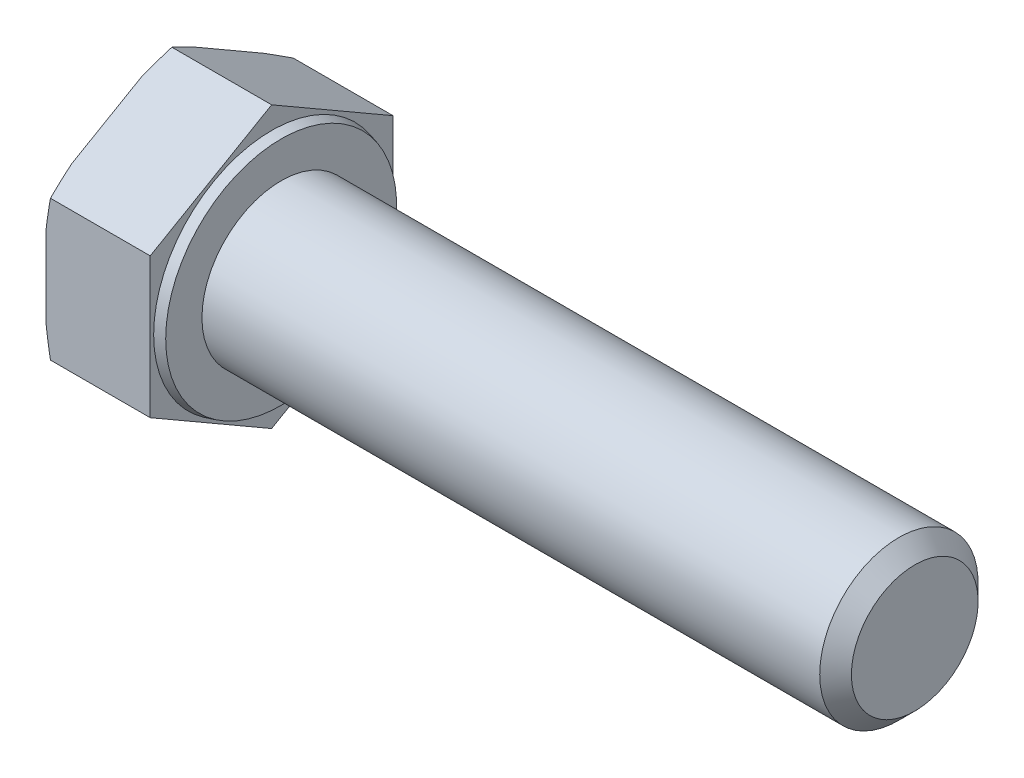
ISO-10303-21;
HEADER;
FILE_DESCRIPTION(('STEP AP214'),'2;1');
FILE_NAME('part.step','',(''),(''),'','','');
FILE_SCHEMA(('AUTOMOTIVE_DESIGN { 1 0 10303 214 1 1 1 1 }'));
ENDSEC;
DATA;
#1=APPLICATION_CONTEXT('core data for automotive mechanical design processes');
#2=APPLICATION_PROTOCOL_DEFINITION('international standard','automotive_design',2000,#1);
#3=PRODUCT_CONTEXT('',#1,'mechanical');
#4=PRODUCT('Part','Part','',(#3));
#5=PRODUCT_RELATED_PRODUCT_CATEGORY('part','',(#4));
#6=PRODUCT_DEFINITION_FORMATION('','',#4);
#7=PRODUCT_DEFINITION_CONTEXT('part definition',#1,'design');
#8=PRODUCT_DEFINITION('design','',#6,#7);
#9=PRODUCT_DEFINITION_SHAPE('','',#8);
#10=(LENGTH_UNIT() NAMED_UNIT(*) SI_UNIT(.MILLI.,.METRE.));
#11=(NAMED_UNIT(*) PLANE_ANGLE_UNIT() SI_UNIT($,.RADIAN.));
#12=(NAMED_UNIT(*) SI_UNIT($,.STERADIAN.) SOLID_ANGLE_UNIT());
#13=UNCERTAINTY_MEASURE_WITH_UNIT(LENGTH_MEASURE(1.E-05),#10,'distance_accuracy_value','');
#14=(GEOMETRIC_REPRESENTATION_CONTEXT(3) GLOBAL_UNCERTAINTY_ASSIGNED_CONTEXT((#13)) GLOBAL_UNIT_ASSIGNED_CONTEXT((#10,
#11,#12)) REPRESENTATION_CONTEXT('',''));
#15=CARTESIAN_POINT('',(0.,0.,0.));
#16=DIRECTION('',(0.,0.,1.));
#17=DIRECTION('',(1.,0.,0.));
#18=AXIS2_PLACEMENT_3D('',#15,#16,#17);
#19=CARTESIAN_POINT('',(40.6,-4.42500000000009,-7.66432482349223));
#20=DIRECTION('',(0.,-0.866025403784441,-0.499999999999995));
#21=DIRECTION('',(0.,0.499999999999995,-0.866025403784442));
#22=AXIS2_PLACEMENT_3D('',#19,#20,#21);
#23=PLANE('',#22);
#24=DIRECTION('',(-1.,0.,0.));
#25=VECTOR('',#24,1.);
#26=CARTESIAN_POINT('',(40.6,-8.85,0.));
#27=LINE('',#26,#25);
#28=CARTESIAN_POINT('',(0.,-8.85,0.));
#29=VERTEX_POINT('',#28);
#30=CARTESIAN_POINT('',(-6.29792306844368,-8.85,0.));
#31=VERTEX_POINT('',#30);
#32=EDGE_CURVE('E164',#29,#31,#27,.T.);
#33=ORIENTED_EDGE('',*,*,#32,.T.);
#34=CARTESIAN_POINT('',(-4.7699615006699,-11.9174022332107,5.3128965151713));
#35=CARTESIAN_POINT('',(-4.83614833570257,-11.8050473190038,5.11829209528478));
#36=CARTESIAN_POINT('',(-4.90167255003095,-11.6925948603644,4.92351872348535));
#37=CARTESIAN_POINT('',(-5.03118559698242,-11.4674663528304,4.53358471020429));
#38=CARTESIAN_POINT('',(-5.09517439305191,-11.3547902986816,4.33842405962226));
#39=CARTESIAN_POINT('',(-5.28456041407139,-11.0163157536771,3.75216895060564));
#40=CARTESIAN_POINT('',(-5.40733223857273,-10.7901468045143,3.3604328395613));
#41=CARTESIAN_POINT('',(-5.64480594732521,-10.3342684187143,2.57082831328319));
#42=CARTESIAN_POINT('',(-5.75941225873481,-10.1045464495324,2.17293819104532));
#43=CARTESIAN_POINT('',(-5.97591685440881,-9.6436033227612,1.37456127607789));
#44=CARTESIAN_POINT('',(-6.07781581130404,-9.41238224520544,0.974074621970503));
#45=CARTESIAN_POINT('',(-6.26134144326315,-8.95638364479248,0.184261877874948));
#46=CARTESIAN_POINT('',(-6.34355573274743,-8.73166601658844,-0.204960471530832));
#47=CARTESIAN_POINT('',(-6.48746045966098,-8.28055127837509,-0.986314118159494));
#48=CARTESIAN_POINT('',(-6.54915189984519,-8.05415425097466,-1.37844527229961));
#49=CARTESIAN_POINT('',(-6.62254434564547,-7.71410474496151,-1.9674282938031));
#50=CARTESIAN_POINT('',(-6.64378861584913,-7.60095958105454,-2.16340146632069));
#51=CARTESIAN_POINT('',(-6.67950592063896,-7.37440457175731,-2.55580625313272));
#52=CARTESIAN_POINT('',(-6.69397933196105,-7.26099474144627,-2.75223784130922));
#53=CARTESIAN_POINT('',(-6.7157765759338,-7.03401139991638,-3.14538452131075));
#54=CARTESIAN_POINT('',(-6.72310096885371,-6.92043790222291,-3.34209958970915));
#55=CARTESIAN_POINT('',(-6.73040192529393,-6.69323186195545,-3.73563199523894));
#56=CARTESIAN_POINT('',(-6.73037853713207,-6.57959931977464,-3.93244933168932));
#57=CARTESIAN_POINT('',(-6.72320871548941,-6.35929562962563,-4.31402651612232));
#58=CARTESIAN_POINT('',(-6.71649505277964,-6.25262090601261,-4.49879255730344));
#59=CARTESIAN_POINT('',(-6.69675463432834,-6.03941600442701,-4.86807427927243));
#60=CARTESIAN_POINT('',(-6.68372760236287,-5.93288583298343,-5.05258994875172));
#61=CARTESIAN_POINT('',(-6.63559663675346,-5.61363013252953,-5.60555704254388));
#62=CARTESIAN_POINT('',(-6.59144268713134,-5.40123548697151,-5.97343535990596));
#63=CARTESIAN_POINT('',(-6.48226269320506,-4.97681311893132,-6.70855646522027));
#64=CARTESIAN_POINT('',(-6.41713860156276,-4.7647919199632,-7.07578795411474));
#65=CARTESIAN_POINT('',(-6.27018625376656,-4.34222339340586,-7.80769811179158));
#66=CARTESIAN_POINT('',(-6.18835790112246,-4.1316760743376,-8.17237676581522));
#67=CARTESIAN_POINT('',(-6.00866271800198,-3.70472589760515,-8.91187616421634));
#68=CARTESIAN_POINT('',(-5.91033992742069,-3.48837165185492,-9.286612710289));
#69=CARTESIAN_POINT('',(-5.70311989656312,-3.05693413716248,-10.0338844060276));
#70=CARTESIAN_POINT('',(-5.59422212603359,-2.84185093252738,-10.4064194443103));
#71=CARTESIAN_POINT('',(-5.36943684134144,-2.41473283183158,-11.1462096955477));
#72=CARTESIAN_POINT('',(-5.25362330968472,-2.2026881429877,-11.5134818701005));
#73=CARTESIAN_POINT('',(-5.07537550670142,-1.88529185166038,-12.0632283728133));
#74=CARTESIAN_POINT('',(-5.01521325258259,-1.77961882394802,-12.2462594258008));
#75=CARTESIAN_POINT('',(-4.89354912869936,-1.56846779942573,-12.6119837283436));
#76=CARTESIAN_POINT('',(-4.83204728425027,-1.462989798971,-12.794676984212));
#77=CARTESIAN_POINT('',(-4.7699615006699,-1.35759776678936,-12.9772213386635));
#78=B_SPLINE_CURVE_WITH_KNOTS('',3,(#34,#35,#36,#37,#38,#39,#40,#41,#42,#43,#44,#45,#46,#47,#48,
#49,#50,#51,#52,#53,#54,#55,#56,#57,#58,#59,#60,#61,#62,#63,#64,#65,#66,#67,#68,#69,#70,#71,#72,
#73,#74,#75,#76,#77),.UNSPECIFIED.,.F.,.F.,(4,2,2,2,2,2,2,2,2,2,2,2,2,2,2,2,2,2,2,2,2,4),(0.,
0.70276173034238,1.40554017472233,2.81157217612387,4.23201032618944,5.6523732571052,
7.02270828812482,8.39297635416767,9.07474696516834,9.75647963740092,10.438158877887,
11.119833635759,11.7601005309412,12.4003954417532,13.6809617128842,14.9676044823533,
16.2542546841745,17.5852978857349,18.9164078632869,20.2352036230902,20.894426976119,
21.553637882061),.UNSPECIFIED.);
#79=CARTESIAN_POINT('',(-6.58000000000003,-7.90869530364146,-1.63038755949604));
#80=VERTEX_POINT('',#79);
#81=EDGE_CURVE('E209',#31,#80,#78,.T.);
#82=ORIENTED_EDGE('',*,*,#81,.T.);
#83=DIRECTION('',(0.,-0.499999999999995,0.866025403784442));
#84=VECTOR('',#83,1.);
#85=CARTESIAN_POINT('',(-6.58,-4.42500000000009,-7.66432482349223));
#86=LINE('',#85,#84);
#87=CARTESIAN_POINT('',(-6.58,-5.36630469635854,-6.03393726399618));
#88=VERTEX_POINT('',#87);
#89=EDGE_CURVE('E219',#88,#80,#86,.T.);
#90=ORIENTED_EDGE('',*,*,#89,.F.);
#91=CARTESIAN_POINT('',(-6.29792306844368,-4.42500000000009,-7.66432482349223));
#92=VERTEX_POINT('',#91);
#93=EDGE_CURVE('E222',#88,#92,#78,.T.);
#94=ORIENTED_EDGE('',*,*,#93,.T.);
#95=DIRECTION('',(-1.,0.,0.));
#96=VECTOR('',#95,1.);
#97=CARTESIAN_POINT('',(40.6,-4.42500000000009,-7.66432482349223));
#98=LINE('',#97,#96);
#99=CARTESIAN_POINT('',(0.,-4.42500000000009,-7.66432482349223));
#100=VERTEX_POINT('',#99);
#101=EDGE_CURVE('E175',#100,#92,#98,.T.);
#102=ORIENTED_EDGE('',*,*,#101,.F.);
#103=DIRECTION('',(0.,-0.499999999999995,0.866025403784442));
#104=VECTOR('',#103,1.);
#105=CARTESIAN_POINT('',(0.,-4.42500000000009,-7.66432482349223));
#106=LINE('',#105,#104);
#107=EDGE_CURVE('E190',#100,#29,#106,.T.);
#108=ORIENTED_EDGE('',*,*,#107,.T.);
#109=EDGE_LOOP('',(#33,#82,#90,#94,#102,#108));
#110=FACE_BOUND('',#109,.T.);
#111=ADVANCED_FACE('F42',(#110),#23,.T.);
#112=CARTESIAN_POINT('',(40.6,4.42499999999993,-7.66432482349232));
#113=DIRECTION('',(0.,0.,-1.));
#114=DIRECTION('',(0.,1.,0.));
#115=AXIS2_PLACEMENT_3D('',#112,#113,#114);
#116=PLANE('',#115);
#117=ORIENTED_EDGE('',*,*,#101,.T.);
#118=CARTESIAN_POINT('',(-5.00864005639831,-9.73789651517145,-7.66432482349217));
#119=CARTESIAN_POINT('',(-5.07003318744064,-9.52322769233334,-7.66432482349218));
#120=CARTESIAN_POINT('',(-5.13071664914256,-9.30835600664128,-7.66432482349218));
#121=CARTESIAN_POINT('',(-5.2504442425723,-8.87815277711283,-7.66432482349218));
#122=CARTESIAN_POINT('',(-5.30948834652955,-8.66282122555281,-7.66432482349219));
#123=CARTESIAN_POINT('',(-5.48387527888684,-8.01589307910885,-7.66432482349219));
#124=CARTESIAN_POINT('',(-5.59642298983084,-7.58353558067021,-7.6643248234922));
#125=CARTESIAN_POINT('',(-5.81266226723173,-6.71259000391773,-7.66432482349221));
#126=CARTESIAN_POINT('',(-5.91626806915323,-6.27398046842187,-7.66432482349221));
#127=CARTESIAN_POINT('',(-6.11029091280608,-5.39384656433909,-7.66432482349222));
#128=CARTESIAN_POINT('',(-6.20070892550878,-4.95232241284974,-7.66432482349222));
#129=CARTESIAN_POINT('',(-6.36160933963008,-4.08051166755351,-7.66432482349223));
#130=CARTESIAN_POINT('',(-6.43264625776086,-3.65032885049375,-7.66432482349224));
#131=CARTESIAN_POINT('',(-6.55428187483288,-2.78707107422335,-7.66432482349225));
#132=CARTESIAN_POINT('',(-6.60488453148917,-2.35399669158535,-7.66432482349225));
#133=CARTESIAN_POINT('',(-6.66240831794471,-1.70368188145931,-7.66432482349226));
#134=CARTESIAN_POINT('',(-6.67850532779577,-1.48723464984804,-7.66432482349226));
#135=CARTESIAN_POINT('',(-6.70429433272965,-1.05396299728827,-7.66432482349227));
#136=CARTESIAN_POINT('',(-6.71398664875919,-0.837138595786226,-7.66432482349227));
#137=CARTESIAN_POINT('',(-6.72672253024382,-0.403302294793051,-7.66432482349227));
#138=CARTESIAN_POINT('',(-6.72976638437883,-0.186290403852155,-7.66432482349227));
#139=CARTESIAN_POINT('',(-6.7291358967764,0.247718950123678,-7.66432482349228));
#140=CARTESIAN_POINT('',(-6.72546155695146,0.464716413162706,-7.66432482349228));
#141=CARTESIAN_POINT('',(-6.70624362970486,1.06036953223341,-7.66432482349229));
#142=CARTESIAN_POINT('',(-6.68388895075078,1.43882252598365,-7.66432482349229));
#143=CARTESIAN_POINT('',(-6.62050559151052,2.19412494594648,-7.6643248234923));
#144=CARTESIAN_POINT('',(-6.57947609181733,2.57097430106276,-7.6643248234923));
#145=CARTESIAN_POINT('',(-6.48113797206862,3.32388976987407,-7.66432482349231));
#146=CARTESIAN_POINT('',(-6.4237712185853,3.69994816672772,-7.66432482349232));
#147=CARTESIAN_POINT('',(-6.2956564145037,4.44978573942378,-7.66432482349232));
#148=CARTESIAN_POINT('',(-6.22490691200718,4.82356466341955,-7.66432482349233));
#149=CARTESIAN_POINT('',(-6.0704014797458,5.58003633732887,-7.66432482349234));
#150=CARTESIAN_POINT('',(-5.98632024183774,5.96266195818458,-7.66432482349234));
#151=CARTESIAN_POINT('',(-5.80919867667365,6.72583533235177,-7.66432482349235));
#152=CARTESIAN_POINT('',(-5.71615790531566,7.10638298167437,-7.66432482349235));
#153=CARTESIAN_POINT('',(-5.52374117974904,7.86297645537245,-7.66432482349236));
#154=CARTESIAN_POINT('',(-5.42441511026811,8.23903503370974,-7.66432482349236));
#155=CARTESIAN_POINT('',(-5.27134102225385,8.80195695976291,-7.66432482349237));
#156=CARTESIAN_POINT('',(-5.21964171692946,8.98938164843282,-7.66432482349237));
#157=CARTESIAN_POINT('',(-5.11502150400523,9.36388780999383,-7.66432482349237));
#158=CARTESIAN_POINT('',(-5.06210060924165,9.55096928646908,-7.66432482349238));
#159=CARTESIAN_POINT('',(-5.00864005639831,9.73789651517129,-7.66432482349238));
#160=B_SPLINE_CURVE_WITH_KNOTS('',3,(#118,#119,#120,#121,#122,#123,#124,#125,#126,#127,#128,
#129,#130,#131,#132,#133,#134,#135,#136,#137,#138,#139,#140,#141,#142,#143,#144,#145,#146,#147,
#148,#149,#150,#151,#152,#153,#154,#155,#156,#157,#158,#159),.UNSPECIFIED.,.F.,.F.,(4,2,2,2,2,2,
2,2,2,2,2,2,2,2,2,2,2,2,2,2,4),(0.,0.669823290546161,1.33965792092904,2.67986595636369,
4.03175825312792,5.38355096443301,6.69120700403605,7.99860965473741,8.64966414612008,
9.300686009923,9.95167960543101,10.6026730156168,11.7394565125237,12.876289893615,
14.0172201663474,15.1582742899967,16.3334026116279,17.5085892114817,18.6753990362947,
19.2586689197893,19.8419326771629),.UNSPECIFIED.);
#161=CARTESIAN_POINT('',(-6.58000000000003,-2.54239060728318,-7.66432482349217));
#162=VERTEX_POINT('',#161);
#163=EDGE_CURVE('E230',#92,#162,#160,.T.);
#164=ORIENTED_EDGE('',*,*,#163,.T.);
#165=DIRECTION('',(0.,-1.,0.));
#166=VECTOR('',#165,1.);
#167=CARTESIAN_POINT('',(-6.58,4.42499999999993,-7.66432482349232));
#168=LINE('',#167,#166);
#169=CARTESIAN_POINT('',(-6.58,2.54239060728305,-7.6643248234923));
#170=VERTEX_POINT('',#169);
#171=EDGE_CURVE('E170',#170,#162,#168,.T.);
#172=ORIENTED_EDGE('',*,*,#171,.F.);
#173=CARTESIAN_POINT('',(-6.29792306844368,4.42499999999993,-7.66432482349232));
#174=VERTEX_POINT('',#173);
#175=EDGE_CURVE('E57',#170,#174,#160,.T.);
#176=ORIENTED_EDGE('',*,*,#175,.T.);
#177=DIRECTION('',(-1.,0.,0.));
#178=VECTOR('',#177,1.);
#179=CARTESIAN_POINT('',(40.6,4.42499999999993,-7.66432482349232));
#180=LINE('',#179,#178);
#181=CARTESIAN_POINT('',(0.,4.42499999999993,-7.66432482349232));
#182=VERTEX_POINT('',#181);
#183=EDGE_CURVE('E161',#182,#174,#180,.T.);
#184=ORIENTED_EDGE('',*,*,#183,.F.);
#185=DIRECTION('',(0.,-1.,0.));
#186=VECTOR('',#185,1.);
#187=CARTESIAN_POINT('',(0.,8.84999999999992,-7.66432482349237));
#188=LINE('',#187,#186);
#189=EDGE_CURVE('E188',#182,#100,#188,.T.);
#190=ORIENTED_EDGE('',*,*,#189,.T.);
#191=EDGE_LOOP('',(#117,#164,#172,#176,#184,#190));
#192=FACE_BOUND('',#191,.T.);
#193=ADVANCED_FACE('F257',(#192),#116,.T.);
#194=CARTESIAN_POINT('',(40.6,8.85,0.));
#195=DIRECTION('',(0.,0.866025403784434,-0.500000000000007));
#196=DIRECTION('',(0.,0.500000000000007,0.866025403784435));
#197=AXIS2_PLACEMENT_3D('',#194,#195,#196);
#198=PLANE('',#197);
#199=ORIENTED_EDGE('',*,*,#183,.T.);
#200=CARTESIAN_POINT('',(-4.76996150066986,1.35759776678906,-12.9772213386637));
#201=CARTESIAN_POINT('',(-4.83614833570252,1.46995268099604,-12.7826169187772));
#202=CARTESIAN_POINT('',(-4.9016725500309,1.58240513963541,-12.5878435469777));
#203=CARTESIAN_POINT('',(-5.03118559698238,1.80753364716942,-12.1979095336967));
#204=CARTESIAN_POINT('',(-5.09517439305187,1.92020970131818,-12.0027488831146));
#205=CARTESIAN_POINT('',(-5.28456041407135,2.25868424632273,-11.416493774098));
#206=CARTESIAN_POINT('',(-5.40733223857269,2.48485319548548,-11.0247576630537));
#207=CARTESIAN_POINT('',(-5.64480594732517,2.9407315812855,-10.2351531367756));
#208=CARTESIAN_POINT('',(-5.75941225873478,3.17045355046743,-9.83726301453771));
#209=CARTESIAN_POINT('',(-5.97591685440879,3.63139667723867,-9.03888609957028));
#210=CARTESIAN_POINT('',(-6.07781581130402,3.86261775479443,-8.63839944546289));
#211=CARTESIAN_POINT('',(-6.26134144326313,4.3186163552074,-7.84858670136733));
#212=CARTESIAN_POINT('',(-6.34355573274742,4.54333398341145,-7.45936435196155));
#213=CARTESIAN_POINT('',(-6.48746045966097,4.99444872162482,-6.67801070533289));
#214=CARTESIAN_POINT('',(-6.54915189984519,5.22084574902526,-6.28587955119277));
#215=CARTESIAN_POINT('',(-6.62254434564547,5.56089525503842,-5.69689652968929));
#216=CARTESIAN_POINT('',(-6.64378861584913,5.67404041894539,-5.5009233571717));
#217=CARTESIAN_POINT('',(-6.67950592063896,5.90059542824263,-5.10851857035966));
#218=CARTESIAN_POINT('',(-6.69397933196106,6.01400525855368,-4.91208698218317));
#219=CARTESIAN_POINT('',(-6.7157765759338,6.24098860008357,-4.51894030218163));
#220=CARTESIAN_POINT('',(-6.72310096885372,6.35456209777704,-4.32222523378324));
#221=CARTESIAN_POINT('',(-6.73040192529394,6.58176813804451,-3.92869282825345));
#222=CARTESIAN_POINT('',(-6.73037853713208,6.69540068022533,-3.73187549180306));
#223=CARTESIAN_POINT('',(-6.72320871548943,6.91570437037435,-3.35029830737006));
#224=CARTESIAN_POINT('',(-6.71649505277966,7.02237909398738,-3.16553226618893));
#225=CARTESIAN_POINT('',(-6.69675463432836,7.23558399557298,-2.79625054421994));
#226=CARTESIAN_POINT('',(-6.68372760236289,7.34211416701656,-2.61173487474064));
#227=CARTESIAN_POINT('',(-6.63559663675348,7.66136986747048,-2.05876778094847));
#228=CARTESIAN_POINT('',(-6.59144268713136,7.87376451302851,-1.69088946358639));
#229=CARTESIAN_POINT('',(-6.48226269320508,8.29818688106872,-0.955768358272068));
#230=CARTESIAN_POINT('',(-6.41713860156277,8.51020808003686,-0.588536869377595));
#231=CARTESIAN_POINT('',(-6.27018625376657,8.93277660659422,0.14337328829926));
#232=CARTESIAN_POINT('',(-6.18835790112246,9.14332392566248,0.508051942322904));
#233=CARTESIAN_POINT('',(-6.00866271800198,9.57027410239495,1.24755134072404));
#234=CARTESIAN_POINT('',(-5.91033992742068,9.7866283481452,1.62228788679671));
#235=CARTESIAN_POINT('',(-5.7031198965631,10.2180658628377,2.36955958253527));
#236=CARTESIAN_POINT('',(-5.59422212603357,10.4331490674728,2.74209462081801));
#237=CARTESIAN_POINT('',(-5.36943684134141,10.8602671681686,3.48188487205548));
#238=CARTESIAN_POINT('',(-5.25362330968469,11.0723118570125,3.84915704660822));
#239=CARTESIAN_POINT('',(-5.07537550670138,11.3897081483398,4.3989035493211));
#240=CARTESIAN_POINT('',(-5.01521325258256,11.4953811760522,4.58193460230855));
#241=CARTESIAN_POINT('',(-4.89354912869932,11.7065322005745,4.94765890485139));
#242=CARTESIAN_POINT('',(-4.83204728425022,11.8120102010292,5.13035216071975));
#243=CARTESIAN_POINT('',(-4.76996150066986,11.9174022332109,5.3128965151713));
#244=B_SPLINE_CURVE_WITH_KNOTS('',3,(#200,#201,#202,#203,#204,#205,#206,#207,#208,#209,#210,
#211,#212,#213,#214,#215,#216,#217,#218,#219,#220,#221,#222,#223,#224,#225,#226,#227,#228,#229,
#230,#231,#232,#233,#234,#235,#236,#237,#238,#239,#240,#241,#242,#243),.UNSPECIFIED.,.F.,.F.,(4,
2,2,2,2,2,2,2,2,2,2,2,2,2,2,2,2,2,2,2,2,4),(0.,0.702761730342385,1.40554017472234,
2.81157217612389,4.23201032618948,5.65237325710526,7.02270828812488,8.39297635416774,
9.07474696516842,9.75647963740101,10.4381588778871,11.1198336357591,11.7601005309413,
12.4003954417533,13.6809617128843,14.9676044823535,16.2542546841748,17.5852978857351,
18.9164078632872,20.2352036230905,20.8944269761194,21.5536378820613),.UNSPECIFIED.);
#245=CARTESIAN_POINT('',(-6.58000000000003,5.36630469635833,-6.03393726399625));
#246=VERTEX_POINT('',#245);
#247=EDGE_CURVE('E252',#174,#246,#244,.T.);
#248=ORIENTED_EDGE('',*,*,#247,.T.);
#249=DIRECTION('',(0.,-0.500000000000007,-0.866025403784435));
#250=VECTOR('',#249,1.);
#251=CARTESIAN_POINT('',(-6.58,8.85,0.));
#252=LINE('',#251,#250);
#253=CARTESIAN_POINT('',(-6.58,7.90869530364155,-1.63038755949607));
#254=VERTEX_POINT('',#253);
#255=EDGE_CURVE('E242',#254,#246,#252,.T.);
#256=ORIENTED_EDGE('',*,*,#255,.F.);
#257=CARTESIAN_POINT('',(-6.29792306844368,8.85,0.));
#258=VERTEX_POINT('',#257);
#259=EDGE_CURVE('E65',#254,#258,#244,.T.);
#260=ORIENTED_EDGE('',*,*,#259,.T.);
#261=DIRECTION('',(-1.,0.,0.));
#262=VECTOR('',#261,1.);
#263=CARTESIAN_POINT('',(40.6,8.85,0.));
#264=LINE('',#263,#262);
#265=CARTESIAN_POINT('',(0.,8.85,0.));
#266=VERTEX_POINT('',#265);
#267=EDGE_CURVE('E158',#266,#258,#264,.T.);
#268=ORIENTED_EDGE('',*,*,#267,.F.);
#269=DIRECTION('',(0.,-0.500000000000007,-0.866025403784435));
#270=VECTOR('',#269,1.);
#271=CARTESIAN_POINT('',(0.,8.85000000000003,0.));
#272=LINE('',#271,#270);
#273=EDGE_CURVE('E186',#266,#182,#272,.T.);
#274=ORIENTED_EDGE('',*,*,#273,.T.);
#275=EDGE_LOOP('',(#199,#248,#256,#260,#268,#274));
#276=FACE_BOUND('',#275,.T.);
#277=ADVANCED_FACE('F250',(#276),#198,.T.);
#278=CARTESIAN_POINT('',(40.6,4.42500000000004,7.66432482349226));
#279=DIRECTION('',(0.,0.866025403784441,0.499999999999995));
#280=DIRECTION('',(0.,-0.499999999999995,0.866025403784442));
#281=AXIS2_PLACEMENT_3D('',#278,#279,#280);
#282=PLANE('',#281);
#283=ORIENTED_EDGE('',*,*,#267,.T.);
#284=CARTESIAN_POINT('',(-4.76996150066987,11.9174022332108,-5.31289651517143));
#285=CARTESIAN_POINT('',(-4.83614833570254,11.8050473190038,-5.1182920952849));
#286=CARTESIAN_POINT('',(-4.90167255003092,11.6925948603644,-4.92351872348547));
#287=CARTESIAN_POINT('',(-5.03118559698239,11.4674663528304,-4.53358471020441));
#288=CARTESIAN_POINT('',(-5.09517439305188,11.3547902986817,-4.33842405962238));
#289=CARTESIAN_POINT('',(-5.28456041407136,11.0163157536771,-3.75216895060575));
#290=CARTESIAN_POINT('',(-5.40733223857271,10.7901468045144,-3.36043283956142));
#291=CARTESIAN_POINT('',(-5.64480594732519,10.3342684187144,-2.5708283132833));
#292=CARTESIAN_POINT('',(-5.75941225873479,10.1045464495324,-2.17293819104544));
#293=CARTESIAN_POINT('',(-5.9759168544088,9.64360332276122,-1.374561276078));
#294=CARTESIAN_POINT('',(-6.07781581130403,9.41238224520547,-0.974074621970606));
#295=CARTESIAN_POINT('',(-6.26134144326314,8.95638364479251,-0.184261877875046));
#296=CARTESIAN_POINT('',(-6.34355573274742,8.73166601658846,0.204960471530735));
#297=CARTESIAN_POINT('',(-6.48746045966097,8.28055127837511,0.986314118159402));
#298=CARTESIAN_POINT('',(-6.54915189984519,8.05415425097468,1.37844527229952));
#299=CARTESIAN_POINT('',(-6.62254434564547,7.71410474496153,1.96742829380301));
#300=CARTESIAN_POINT('',(-6.64378861584914,7.60095958105455,2.1634014663206));
#301=CARTESIAN_POINT('',(-6.67950592063896,7.37440457175733,2.55580625313264));
#302=CARTESIAN_POINT('',(-6.69397933196106,7.26099474144628,2.75223784130914));
#303=CARTESIAN_POINT('',(-6.7157765759338,7.03401139991639,3.14538452131067));
#304=CARTESIAN_POINT('',(-6.72310096885372,6.92043790222292,3.34209958970907));
#305=CARTESIAN_POINT('',(-6.73040192529394,6.69323186195546,3.73563199523886));
#306=CARTESIAN_POINT('',(-6.73037853713208,6.57959931977464,3.93244933168925));
#307=CARTESIAN_POINT('',(-6.72320871548943,6.35929562962563,4.31402651612225));
#308=CARTESIAN_POINT('',(-6.71649505277966,6.25262090601261,4.49879255730337));
#309=CARTESIAN_POINT('',(-6.69675463432836,6.03941600442701,4.86807427927237));
#310=CARTESIAN_POINT('',(-6.68372760236289,5.93288583298343,5.05258994875167));
#311=CARTESIAN_POINT('',(-6.63559663675348,5.61363013252952,5.60555704254384));
#312=CARTESIAN_POINT('',(-6.59144268713136,5.40123548697149,5.97343535990593));
#313=CARTESIAN_POINT('',(-6.48226269320508,4.9768131189313,6.70855646522025));
#314=CARTESIAN_POINT('',(-6.41713860156277,4.76479191996317,7.07578795411472));
#315=CARTESIAN_POINT('',(-6.27018625376657,4.34222339340582,7.80769811179158));
#316=CARTESIAN_POINT('',(-6.18835790112247,4.13167607433757,8.17237676581522));
#317=CARTESIAN_POINT('',(-6.00866271800198,3.70472589760511,8.91187616421636));
#318=CARTESIAN_POINT('',(-5.91033992742069,3.48837165185487,9.28661271028903));
#319=CARTESIAN_POINT('',(-5.70311989656311,3.05693413716242,10.0338844060276));
#320=CARTESIAN_POINT('',(-5.59422212603358,2.84185093252732,10.4064194443103));
#321=CARTESIAN_POINT('',(-5.36943684134142,2.41473283183151,11.1462096955478));
#322=CARTESIAN_POINT('',(-5.2536233096847,2.20268814298763,11.5134818701005));
#323=CARTESIAN_POINT('',(-5.07537550670139,1.88529185166029,12.0632283728134));
#324=CARTESIAN_POINT('',(-5.01521325258257,1.77961882394794,12.2462594258009));
#325=CARTESIAN_POINT('',(-4.89354912869933,1.56846779942564,12.6119837283437));
#326=CARTESIAN_POINT('',(-4.83204728425024,1.46298979897091,12.7946769842121));
#327=CARTESIAN_POINT('',(-4.76996150066987,1.35759776678927,12.9772213386636));
#328=B_SPLINE_CURVE_WITH_KNOTS('',3,(#284,#285,#286,#287,#288,#289,#290,#291,#292,#293,#294,
#295,#296,#297,#298,#299,#300,#301,#302,#303,#304,#305,#306,#307,#308,#309,#310,#311,#312,#313,
#314,#315,#316,#317,#318,#319,#320,#321,#322,#323,#324,#325,#326,#327),.UNSPECIFIED.,.F.,.F.,(4,
2,2,2,2,2,2,2,2,2,2,2,2,2,2,2,2,2,2,2,2,4),(0.,0.702761730342385,1.40554017472234,
2.81157217612389,4.23201032618946,5.65237325710524,7.02270828812486,8.39297635416772,
9.07474696516839,9.75647963740098,10.4381588778871,11.119833635759,11.7601005309412,
12.4003954417533,13.6809617128843,14.9676044823535,16.2542546841747,17.585297885735,
18.9164078632871,20.2352036230904,20.8944269761193,21.5536378820612),.UNSPECIFIED.);
#329=CARTESIAN_POINT('',(-6.58000000000003,7.90869530364148,1.63038755949594));
#330=VERTEX_POINT('',#329);
#331=EDGE_CURVE('E152',#258,#330,#328,.T.);
#332=ORIENTED_EDGE('',*,*,#331,.T.);
#333=DIRECTION('',(0.,0.499999999999995,-0.866025403784442));
#334=VECTOR('',#333,1.);
#335=CARTESIAN_POINT('',(-6.58,4.42500000000004,7.66432482349226));
#336=LINE('',#335,#334);
#337=CARTESIAN_POINT('',(-6.58,5.36630469635847,6.03393726399624));
#338=VERTEX_POINT('',#337);
#339=EDGE_CURVE('E151',#338,#330,#336,.T.);
#340=ORIENTED_EDGE('',*,*,#339,.F.);
#341=CARTESIAN_POINT('',(-6.29792306844368,4.42500000000004,7.66432482349226));
#342=VERTEX_POINT('',#341);
#343=EDGE_CURVE('E133',#338,#342,#328,.T.);
#344=ORIENTED_EDGE('',*,*,#343,.T.);
#345=DIRECTION('',(-1.,0.,0.));
#346=VECTOR('',#345,1.);
#347=CARTESIAN_POINT('',(40.6,4.42500000000004,7.66432482349226));
#348=LINE('',#347,#346);
#349=CARTESIAN_POINT('',(0.,4.42500000000004,7.66432482349226));
#350=VERTEX_POINT('',#349);
#351=EDGE_CURVE('E147',#350,#342,#348,.T.);
#352=ORIENTED_EDGE('',*,*,#351,.F.);
#353=DIRECTION('',(0.,0.499999999999995,-0.866025403784442));
#354=VECTOR('',#353,1.);
#355=CARTESIAN_POINT('',(0.,8.84999999999997,0.));
#356=LINE('',#355,#354);
#357=EDGE_CURVE('E184',#350,#266,#356,.T.);
#358=ORIENTED_EDGE('',*,*,#357,.T.);
#359=EDGE_LOOP('',(#283,#332,#340,#344,#352,#358));
#360=FACE_BOUND('',#359,.T.);
#361=ADVANCED_FACE('F146',(#360),#282,.T.);
#362=CARTESIAN_POINT('',(40.6,-4.42499999999998,7.66432482349229));
#363=DIRECTION('',(0.,0.,1.));
#364=DIRECTION('',(0.,-1.,0.));
#365=AXIS2_PLACEMENT_3D('',#362,#363,#364);
#366=PLANE('',#365);
#367=ORIENTED_EDGE('',*,*,#351,.T.);
#368=CARTESIAN_POINT('',(-5.00864005639831,9.7378965151714,7.66432482349224));
#369=CARTESIAN_POINT('',(-5.07003318744064,9.52322769233328,7.66432482349224));
#370=CARTESIAN_POINT('',(-5.13071664914256,9.30835600664122,7.66432482349224));
#371=CARTESIAN_POINT('',(-5.2504442425723,8.87815277711278,7.66432482349225));
#372=CARTESIAN_POINT('',(-5.30948834652955,8.66282122555276,7.66432482349225));
#373=CARTESIAN_POINT('',(-5.48387527888684,8.0158930791088,7.66432482349225));
#374=CARTESIAN_POINT('',(-5.59642298983084,7.58353558067016,7.66432482349225));
#375=CARTESIAN_POINT('',(-5.81266226723173,6.71259000391768,7.66432482349225));
#376=CARTESIAN_POINT('',(-5.91626806915323,6.27398046842182,7.66432482349225));
#377=CARTESIAN_POINT('',(-6.11029091280608,5.39384656433903,7.66432482349226));
#378=CARTESIAN_POINT('',(-6.20070892550878,4.95232241284969,7.66432482349226));
#379=CARTESIAN_POINT('',(-6.36160933963008,4.08051166755345,7.66432482349226));
#380=CARTESIAN_POINT('',(-6.43264625776087,3.6503288504937,7.66432482349226));
#381=CARTESIAN_POINT('',(-6.55428187483288,2.7870710742233,7.66432482349227));
#382=CARTESIAN_POINT('',(-6.60488453148917,2.3539966915853,7.66432482349227));
#383=CARTESIAN_POINT('',(-6.66240831794471,1.70368188145926,7.66432482349227));
#384=CARTESIAN_POINT('',(-6.67850532779577,1.48723464984798,7.66432482349227));
#385=CARTESIAN_POINT('',(-6.70429433272965,1.05396299728821,7.66432482349227));
#386=CARTESIAN_POINT('',(-6.71398664875919,0.83713859578617,7.66432482349227));
#387=CARTESIAN_POINT('',(-6.72672253024382,0.403302294792995,7.66432482349227));
#388=CARTESIAN_POINT('',(-6.72976638437883,0.1862904038521,7.66432482349228));
#389=CARTESIAN_POINT('',(-6.7291358967764,-0.247718950123733,7.66432482349228));
#390=CARTESIAN_POINT('',(-6.72546155695146,-0.46471641316276,7.66432482349228));
#391=CARTESIAN_POINT('',(-6.70624362970486,-1.06036953223346,7.66432482349228));
#392=CARTESIAN_POINT('',(-6.68388895075078,-1.43882252598371,7.66432482349228));
#393=CARTESIAN_POINT('',(-6.62050559151052,-2.19412494594653,7.66432482349228));
#394=CARTESIAN_POINT('',(-6.57947609181733,-2.57097430106281,7.66432482349229));
#395=CARTESIAN_POINT('',(-6.48113797206862,-3.32388976987413,7.66432482349229));
#396=CARTESIAN_POINT('',(-6.4237712185853,-3.69994816672777,7.66432482349229));
#397=CARTESIAN_POINT('',(-6.2956564145037,-4.44978573942384,7.66432482349229));
#398=CARTESIAN_POINT('',(-6.22490691200718,-4.8235646634196,7.66432482349229));
#399=CARTESIAN_POINT('',(-6.0704014797458,-5.58003633732892,7.6643248234923));
#400=CARTESIAN_POINT('',(-5.98632024183774,-5.96266195818463,7.6643248234923));
#401=CARTESIAN_POINT('',(-5.80919867667365,-6.72583533235183,7.6643248234923));
#402=CARTESIAN_POINT('',(-5.71615790531566,-7.10638298167442,7.6643248234923));
#403=CARTESIAN_POINT('',(-5.52374117974904,-7.8629764553725,7.66432482349231));
#404=CARTESIAN_POINT('',(-5.42441511026811,-8.2390350337098,7.66432482349231));
#405=CARTESIAN_POINT('',(-5.27134102225385,-8.80195695976297,7.66432482349231));
#406=CARTESIAN_POINT('',(-5.21964171692946,-8.98938164843288,7.66432482349231));
#407=CARTESIAN_POINT('',(-5.11502150400523,-9.36388780999389,7.66432482349231));
#408=CARTESIAN_POINT('',(-5.06210060924165,-9.55096928646914,7.66432482349231));
#409=CARTESIAN_POINT('',(-5.00864005639831,-9.73789651517135,7.66432482349231));
#410=B_SPLINE_CURVE_WITH_KNOTS('',3,(#368,#369,#370,#371,#372,#373,#374,#375,#376,#377,#378,
#379,#380,#381,#382,#383,#384,#385,#386,#387,#388,#389,#390,#391,#392,#393,#394,#395,#396,#397,
#398,#399,#400,#401,#402,#403,#404,#405,#406,#407,#408,#409),.UNSPECIFIED.,.F.,.F.,(4,2,2,2,2,2,
2,2,2,2,2,2,2,2,2,2,2,2,2,2,4),(0.,0.669823290546161,1.33965792092904,2.67986595636369,
4.03175825312792,5.38355096443301,6.69120700403605,7.99860965473742,8.64966414612009,
9.300686009923,9.95167960543102,10.6026730156168,11.7394565125237,12.876289893615,
14.0172201663474,15.1582742899967,16.3334026116279,17.5085892114817,18.6753990362947,
19.2586689197893,19.8419326771629),.UNSPECIFIED.);
#411=CARTESIAN_POINT('',(-6.58000000000003,2.54239060728313,7.66432482349219));
#412=VERTEX_POINT('',#411);
#413=EDGE_CURVE('E130',#342,#412,#410,.T.);
#414=ORIENTED_EDGE('',*,*,#413,.T.);
#415=DIRECTION('',(0.,1.,0.));
#416=VECTOR('',#415,1.);
#417=CARTESIAN_POINT('',(-6.58,-4.42499999999998,7.66432482349229));
#418=LINE('',#417,#416);
#419=CARTESIAN_POINT('',(-6.58,-2.5423906072831,7.66432482349229));
#420=VERTEX_POINT('',#419);
#421=EDGE_CURVE('E228',#420,#412,#418,.T.);
#422=ORIENTED_EDGE('',*,*,#421,.F.);
#423=CARTESIAN_POINT('',(-6.29792306844368,-4.42499999999998,7.66432482349229));
#424=VERTEX_POINT('',#423);
#425=EDGE_CURVE('E140',#420,#424,#410,.T.);
#426=ORIENTED_EDGE('',*,*,#425,.T.);
#427=DIRECTION('',(-1.,0.,0.));
#428=VECTOR('',#427,1.);
#429=CARTESIAN_POINT('',(40.6,-4.42499999999998,7.66432482349229));
#430=LINE('',#429,#428);
#431=CARTESIAN_POINT('',(0.,-4.42499999999998,7.66432482349229));
#432=VERTEX_POINT('',#431);
#433=EDGE_CURVE('E159',#432,#424,#430,.T.);
#434=ORIENTED_EDGE('',*,*,#433,.F.);
#435=DIRECTION('',(0.,1.,0.));
#436=VECTOR('',#435,1.);
#437=CARTESIAN_POINT('',(0.,8.85000000000003,7.66432482349225));
#438=LINE('',#437,#436);
#439=EDGE_CURVE('E157',#432,#350,#438,.T.);
#440=ORIENTED_EDGE('',*,*,#439,.T.);
#441=EDGE_LOOP('',(#367,#414,#422,#426,#434,#440));
#442=FACE_BOUND('',#441,.T.);
#443=ADVANCED_FACE('F154',(#442),#366,.T.);
#444=CARTESIAN_POINT('',(40.6,-8.85,0.));
#445=DIRECTION('',(0.,-0.866025403784438,0.500000000000001));
#446=DIRECTION('',(0.,-0.500000000000001,-0.866025403784438));
#447=AXIS2_PLACEMENT_3D('',#444,#445,#446);
#448=PLANE('',#447);
#449=ORIENTED_EDGE('',*,*,#433,.T.);
#450=CARTESIAN_POINT('',(-4.76996150066987,-1.35759776678916,12.9772213386637));
#451=CARTESIAN_POINT('',(-4.83614833570253,-1.46995268099614,12.7826169187771));
#452=CARTESIAN_POINT('',(-4.90167255003091,-1.58240513963551,12.5878435469777));
#453=CARTESIAN_POINT('',(-5.03118559698239,-1.80753364716952,12.1979095336966));
#454=CARTESIAN_POINT('',(-5.09517439305187,-1.92020970131828,12.0027488831146));
#455=CARTESIAN_POINT('',(-5.28456041407135,-2.25868424632282,11.416493774098));
#456=CARTESIAN_POINT('',(-5.4073322385727,-2.48485319548557,11.0247576630537));
#457=CARTESIAN_POINT('',(-5.64480594732518,-2.94073158128559,10.2351531367755));
#458=CARTESIAN_POINT('',(-5.75941225873479,-3.17045355046751,9.83726301453767));
#459=CARTESIAN_POINT('',(-5.97591685440879,-3.63139667723874,9.03888609957024));
#460=CARTESIAN_POINT('',(-6.07781581130402,-3.8626177547945,8.63839944546285));
#461=CARTESIAN_POINT('',(-6.26134144326314,-4.31861635520747,7.84858670136729));
#462=CARTESIAN_POINT('',(-6.34355573274742,-4.54333398341151,7.45936435196151));
#463=CARTESIAN_POINT('',(-6.48746045966097,-4.99444872162487,6.67801070533285));
#464=CARTESIAN_POINT('',(-6.54915189984519,-5.22084574902531,6.28587955119272));
#465=CARTESIAN_POINT('',(-6.62254434564547,-5.56089525503846,5.69689652968924));
#466=CARTESIAN_POINT('',(-6.64378861584913,-5.67404041894544,5.50092335717165));
#467=CARTESIAN_POINT('',(-6.67950592063896,-5.90059542824267,5.10851857035961));
#468=CARTESIAN_POINT('',(-6.69397933196106,-6.01400525855372,4.91208698218311));
#469=CARTESIAN_POINT('',(-6.7157765759338,-6.24098860008361,4.51894030218158));
#470=CARTESIAN_POINT('',(-6.72310096885372,-6.35456209777708,4.32222523378318));
#471=CARTESIAN_POINT('',(-6.73040192529394,-6.58176813804454,3.92869282825339));
#472=CARTESIAN_POINT('',(-6.73037853713208,-6.69540068022536,3.73187549180301));
#473=CARTESIAN_POINT('',(-6.72320871548943,-6.91570437037438,3.35029830737));
#474=CARTESIAN_POINT('',(-6.71649505277966,-7.0223790939874,3.16553226618888));
#475=CARTESIAN_POINT('',(-6.69675463432836,-7.23558399557301,2.79625054421989));
#476=CARTESIAN_POINT('',(-6.68372760236289,-7.34211416701659,2.61173487474059));
#477=CARTESIAN_POINT('',(-6.63559663675348,-7.6613698674705,2.05876778094842));
#478=CARTESIAN_POINT('',(-6.59144268713136,-7.87376451302853,1.69088946358633));
#479=CARTESIAN_POINT('',(-6.48226269320508,-8.29818688106873,0.955768358272009));
#480=CARTESIAN_POINT('',(-6.41713860156277,-8.51020808003686,0.588536869377536));
#481=CARTESIAN_POINT('',(-6.27018625376657,-8.93277660659422,-0.14337328829932));
#482=CARTESIAN_POINT('',(-6.18835790112247,-9.14332392566248,-0.508051942322964));
#483=CARTESIAN_POINT('',(-6.00866271800198,-9.57027410239494,-1.2475513407241));
#484=CARTESIAN_POINT('',(-5.91033992742068,-9.78662834814519,-1.62228788679677));
#485=CARTESIAN_POINT('',(-5.7031198965631,-10.2180658628376,-2.36955958253534));
#486=CARTESIAN_POINT('',(-5.59422212603357,-10.4331490674727,-2.74209462081808));
#487=CARTESIAN_POINT('',(-5.36943684134142,-10.8602671681686,-3.48188487205554));
#488=CARTESIAN_POINT('',(-5.25362330968469,-11.0723118570124,-3.84915704660829));
#489=CARTESIAN_POINT('',(-5.07537550670139,-11.3897081483398,-4.39890354932117));
#490=CARTESIAN_POINT('',(-5.01521325258256,-11.4953811760521,-4.58193460230861));
#491=CARTESIAN_POINT('',(-4.89354912869932,-11.7065322005744,-4.94765890485145));
#492=CARTESIAN_POINT('',(-4.83204728425023,-11.8120102010292,-5.13035216071981));
#493=CARTESIAN_POINT('',(-4.76996150066987,-11.9174022332108,-5.31289651517136));
#494=B_SPLINE_CURVE_WITH_KNOTS('',3,(#450,#451,#452,#453,#454,#455,#456,#457,#458,#459,#460,
#461,#462,#463,#464,#465,#466,#467,#468,#469,#470,#471,#472,#473,#474,#475,#476,#477,#478,#479,
#480,#481,#482,#483,#484,#485,#486,#487,#488,#489,#490,#491,#492,#493),.UNSPECIFIED.,.F.,.F.,(4,
2,2,2,2,2,2,2,2,2,2,2,2,2,2,2,2,2,2,2,2,4),(0.,0.702761730342388,1.40554017472235,
2.81157217612389,4.23201032618948,5.65237325710525,7.02270828812487,8.39297635416773,
9.07474696516841,9.756479637401,10.4381588778871,11.1198336357591,11.7601005309413,
12.4003954417533,13.6809617128843,14.9676044823535,16.2542546841747,17.5852978857351,
18.9164078632871,20.2352036230905,20.8944269761193,21.5536378820613),.UNSPECIFIED.);
#495=CARTESIAN_POINT('',(-6.58000000000003,-5.36630469635837,6.03393726399621));
#496=VERTEX_POINT('',#495);
#497=EDGE_CURVE('E220',#424,#496,#494,.T.);
#498=ORIENTED_EDGE('',*,*,#497,.T.);
#499=DIRECTION('',(0.,0.500000000000001,0.866025403784438));
#500=VECTOR('',#499,1.);
#501=CARTESIAN_POINT('',(-6.58,-8.85,0.));
#502=LINE('',#501,#500);
#503=CARTESIAN_POINT('',(-6.58,-7.90869530364156,1.63038755949602));
#504=VERTEX_POINT('',#503);
#505=EDGE_CURVE('E226',#504,#496,#502,.T.);
#506=ORIENTED_EDGE('',*,*,#505,.F.);
#507=EDGE_CURVE('E211',#504,#31,#494,.T.);
#508=ORIENTED_EDGE('',*,*,#507,.T.);
#509=ORIENTED_EDGE('',*,*,#32,.F.);
#510=DIRECTION('',(0.,0.500000000000001,0.866025403784438));
#511=VECTOR('',#510,1.);
#512=CARTESIAN_POINT('',(0.,-4.42499999999998,7.66432482349229));
#513=LINE('',#512,#511);
#514=EDGE_CURVE('E181',#29,#432,#513,.T.);
#515=ORIENTED_EDGE('',*,*,#514,.T.);
#516=EDGE_LOOP('',(#449,#498,#506,#508,#509,#515));
#517=FACE_BOUND('',#516,.T.);
#518=ADVANCED_FACE('F278',(#517),#448,.T.);
#519=CARTESIAN_POINT('',(-6.58,0.,0.));
#520=DIRECTION('',(1.,0.,0.));
#521=DIRECTION('',(0.,0.,-1.));
#522=AXIS2_PLACEMENT_3D('',#519,#520,#521);
#523=PLANE('',#522);
#524=CARTESIAN_POINT('',(-6.58,0.,0.));
#525=DIRECTION('',(1.,0.,0.));
#526=DIRECTION('',(0.,0.,-1.));
#527=AXIS2_PLACEMENT_3D('',#524,#525,#526);
#528=CIRCLE('',#527,8.07500000000009);
#529=EDGE_CURVE('E195',#170,#246,#528,.T.);
#530=ORIENTED_EDGE('',*,*,#529,.F.);
#531=ORIENTED_EDGE('',*,*,#171,.T.);
#532=EDGE_CURVE('E193',#88,#162,#528,.T.);
#533=ORIENTED_EDGE('',*,*,#532,.F.);
#534=ORIENTED_EDGE('',*,*,#89,.T.);
#535=EDGE_CURVE('E194',#504,#80,#528,.T.);
#536=ORIENTED_EDGE('',*,*,#535,.F.);
#537=ORIENTED_EDGE('',*,*,#505,.T.);
#538=EDGE_CURVE('E201',#420,#496,#528,.T.);
#539=ORIENTED_EDGE('',*,*,#538,.F.);
#540=ORIENTED_EDGE('',*,*,#421,.T.);
#541=CARTESIAN_POINT('',(-6.58000000000003,0.,0.));
#542=DIRECTION('',(-1.,0.,0.));
#543=DIRECTION('',(0.,0.,1.));
#544=AXIS2_PLACEMENT_3D('',#541,#542,#543);
#545=CIRCLE('',#544,8.075);
#546=EDGE_CURVE('E135',#412,#338,#545,.T.);
#547=ORIENTED_EDGE('',*,*,#546,.T.);
#548=ORIENTED_EDGE('',*,*,#339,.T.);
#549=EDGE_CURVE('E199',#254,#330,#528,.T.);
#550=ORIENTED_EDGE('',*,*,#549,.F.);
#551=ORIENTED_EDGE('',*,*,#255,.T.);
#552=EDGE_LOOP('',(#530,#531,#533,#534,#536,#537,#539,#540,#547,#548,#550,#551));
#553=FACE_BOUND('',#552,.T.);
#554=ADVANCED_FACE('F224',(#553),#523,.F.);
#555=CARTESIAN_POINT('',(0.,8.85,0.));
#556=DIRECTION('',(-1.,0.,0.));
#557=DIRECTION('',(0.,0.,1.));
#558=AXIS2_PLACEMENT_3D('',#555,#556,#557);
#559=PLANE('',#558);
#560=CARTESIAN_POINT('',(0.,0.,0.));
#561=DIRECTION('',(-1.,0.,0.));
#562=DIRECTION('',(0.,0.,1.));
#563=AXIS2_PLACEMENT_3D('',#560,#561,#562);
#564=CIRCLE('',#563,7.44897459621555);
#565=CARTESIAN_POINT('',(0.,0.,7.44897459621555));
#566=VERTEX_POINT('',#565);
#567=EDGE_CURVE('E178',#566,#566,#564,.T.);
#568=ORIENTED_EDGE('',*,*,#567,.T.);
#569=EDGE_LOOP('',(#568));
#570=FACE_BOUND('',#569,.T.);
#571=ORIENTED_EDGE('',*,*,#107,.F.);
#572=ORIENTED_EDGE('',*,*,#189,.F.);
#573=ORIENTED_EDGE('',*,*,#273,.F.);
#574=ORIENTED_EDGE('',*,*,#357,.F.);
#575=ORIENTED_EDGE('',*,*,#439,.F.);
#576=ORIENTED_EDGE('',*,*,#514,.F.);
#577=EDGE_LOOP('',(#571,#572,#573,#574,#575,#576));
#578=FACE_BOUND('',#577,.T.);
#579=ADVANCED_FACE('F262',(#570,#578),#559,.F.);
#580=CARTESIAN_POINT('',(0.599999999999934,0.,0.));
#581=DIRECTION('',(-1.,0.,0.));
#582=DIRECTION('',(0.,0.,1.));
#583=AXIS2_PLACEMENT_3D('',#580,#581,#582);
#584=CONICAL_SURFACE('',#583,7.28820508075687,0.261799387799175);
#585=ORIENTED_EDGE('',*,*,#567,.F.);
#586=EDGE_LOOP('',(#585));
#587=FACE_BOUND('',#586,.T.);
#588=CARTESIAN_POINT('',(0.599999999999934,0.,0.));
#589=DIRECTION('',(-1.,0.,0.));
#590=DIRECTION('',(0.,0.,1.));
#591=AXIS2_PLACEMENT_3D('',#588,#589,#590);
#592=CIRCLE('',#591,7.28820508075687);
#593=CARTESIAN_POINT('',(0.599999999999934,0.,7.28820508075687));
#594=VERTEX_POINT('',#593);
#595=EDGE_CURVE('E174',#594,#594,#592,.T.);
#596=ORIENTED_EDGE('',*,*,#595,.T.);
#597=EDGE_LOOP('',(#596));
#598=FACE_BOUND('',#597,.T.);
#599=ADVANCED_FACE('F331',(#587,#598),#584,.T.);
#600=CARTESIAN_POINT('',(0.6,7.28820508075687,0.));
#601=DIRECTION('',(-1.,0.,0.));
#602=DIRECTION('',(0.,0.,1.));
#603=AXIS2_PLACEMENT_3D('',#600,#601,#602);
#604=PLANE('',#603);
#605=ORIENTED_EDGE('',*,*,#595,.F.);
#606=EDGE_LOOP('',(#605));
#607=FACE_BOUND('',#606,.T.);
#608=CARTESIAN_POINT('',(0.599999999999934,0.,0.));
#609=DIRECTION('',(-1.,0.,0.));
#610=DIRECTION('',(0.,0.,1.));
#611=AXIS2_PLACEMENT_3D('',#608,#609,#610);
#612=CIRCLE('',#611,5.);
#613=CARTESIAN_POINT('',(0.599999999999934,0.,5.));
#614=VERTEX_POINT('',#613);
#615=EDGE_CURVE('E171',#614,#614,#612,.T.);
#616=ORIENTED_EDGE('',*,*,#615,.T.);
#617=EDGE_LOOP('',(#616));
#618=FACE_BOUND('',#617,.T.);
#619=ADVANCED_FACE('F328',(#607,#618),#604,.F.);
#620=CARTESIAN_POINT('',(-1000.,0.,0.));
#621=DIRECTION('',(-1.,0.,0.));
#622=DIRECTION('',(0.,0.,1.));
#623=AXIS2_PLACEMENT_3D('',#620,#621,#622);
#624=CYLINDRICAL_SURFACE('',#623,5.);
#625=CARTESIAN_POINT('',(39.6000000000001,0.,0.));
#626=DIRECTION('',(-1.,0.,0.));
#627=DIRECTION('',(0.,0.,1.));
#628=AXIS2_PLACEMENT_3D('',#625,#626,#627);
#629=CIRCLE('',#628,5.);
#630=CARTESIAN_POINT('',(39.6000000000001,0.,5.));
#631=VERTEX_POINT('',#630);
#632=EDGE_CURVE('E50',#631,#631,#629,.T.);
#633=ORIENTED_EDGE('',*,*,#632,.T.);
#634=EDGE_LOOP('',(#633));
#635=FACE_BOUND('',#634,.T.);
#636=ORIENTED_EDGE('',*,*,#615,.F.);
#637=EDGE_LOOP('',(#636));
#638=FACE_BOUND('',#637,.T.);
#639=ADVANCED_FACE('F324',(#635,#638),#624,.T.);
#640=CARTESIAN_POINT('',(40.6,5.,0.));
#641=DIRECTION('',(-1.,0.,0.));
#642=DIRECTION('',(0.,0.,1.));
#643=AXIS2_PLACEMENT_3D('',#640,#641,#642);
#644=PLANE('',#643);
#645=CARTESIAN_POINT('',(40.6,0.,0.));
#646=DIRECTION('',(-1.,0.,0.));
#647=DIRECTION('',(0.,0.,1.));
#648=AXIS2_PLACEMENT_3D('',#645,#646,#647);
#649=CIRCLE('',#648,4.00000000000001);
#650=CARTESIAN_POINT('',(40.6,0.,4.00000000000001));
#651=VERTEX_POINT('',#650);
#652=EDGE_CURVE('E12',#651,#651,#649,.F.);
#653=ORIENTED_EDGE('',*,*,#652,.T.);
#654=EDGE_LOOP('',(#653));
#655=FACE_BOUND('',#654,.T.);
#656=ADVANCED_FACE('F321',(#655),#644,.F.);
#657=CARTESIAN_POINT('',(-6.58000000000003,0.,0.));
#658=DIRECTION('',(1.,0.,0.));
#659=DIRECTION('',(0.,0.,-1.));
#660=AXIS2_PLACEMENT_3D('',#657,#658,#659);
#661=CONICAL_SURFACE('',#660,8.075,1.22173047639598);
#662=ORIENTED_EDGE('',*,*,#532,.T.);
#663=ORIENTED_EDGE('',*,*,#163,.F.);
#664=ORIENTED_EDGE('',*,*,#93,.F.);
#665=EDGE_LOOP('',(#662,#663,#664));
#666=FACE_BOUND('',#665,.T.);
#667=ADVANCED_FACE('F284',(#666),#661,.T.);
#668=ORIENTED_EDGE('',*,*,#507,.F.);
#669=ORIENTED_EDGE('',*,*,#535,.T.);
#670=ORIENTED_EDGE('',*,*,#81,.F.);
#671=EDGE_LOOP('',(#668,#669,#670));
#672=FACE_BOUND('',#671,.T.);
#673=ADVANCED_FACE('F208',(#672),#661,.T.);
#674=ORIENTED_EDGE('',*,*,#538,.T.);
#675=ORIENTED_EDGE('',*,*,#497,.F.);
#676=ORIENTED_EDGE('',*,*,#425,.F.);
#677=EDGE_LOOP('',(#674,#675,#676));
#678=FACE_BOUND('',#677,.T.);
#679=ADVANCED_FACE('F283',(#678),#661,.T.);
#680=ORIENTED_EDGE('',*,*,#546,.F.);
#681=ORIENTED_EDGE('',*,*,#413,.F.);
#682=ORIENTED_EDGE('',*,*,#343,.F.);
#683=EDGE_LOOP('',(#680,#681,#682));
#684=FACE_BOUND('',#683,.T.);
#685=ADVANCED_FACE('F132',(#684),#661,.T.);
#686=ORIENTED_EDGE('',*,*,#549,.T.);
#687=ORIENTED_EDGE('',*,*,#331,.F.);
#688=ORIENTED_EDGE('',*,*,#259,.F.);
#689=EDGE_LOOP('',(#686,#687,#688));
#690=FACE_BOUND('',#689,.T.);
#691=ADVANCED_FACE('F386',(#690),#661,.T.);
#692=ORIENTED_EDGE('',*,*,#529,.T.);
#693=ORIENTED_EDGE('',*,*,#247,.F.);
#694=ORIENTED_EDGE('',*,*,#175,.F.);
#695=EDGE_LOOP('',(#692,#693,#694));
#696=FACE_BOUND('',#695,.T.);
#697=ADVANCED_FACE('F370',(#696),#661,.T.);
#698=CARTESIAN_POINT('',(39.6000000000001,0.,0.));
#699=DIRECTION('',(-1.,0.,0.));
#700=DIRECTION('',(0.,0.,1.));
#701=AXIS2_PLACEMENT_3D('',#698,#699,#700);
#702=CONICAL_SURFACE('',#701,5.,0.785398163397484);
#703=ORIENTED_EDGE('',*,*,#652,.F.);
#704=EDGE_LOOP('',(#703));
#705=FACE_BOUND('',#704,.T.);
#706=ORIENTED_EDGE('',*,*,#632,.F.);
#707=EDGE_LOOP('',(#706));
#708=FACE_BOUND('',#707,.T.);
#709=ADVANCED_FACE('F44',(#705,#708),#702,.T.);
#710=CLOSED_SHELL('',(#111,#193,#277,#361,#443,#518,#554,#579,#599,#619,#639,#656,#667,#673,
#679,#685,#691,#697,#709));
#711=MANIFOLD_SOLID_BREP('B2',#710);
#712=ADVANCED_BREP_SHAPE_REPRESENTATION('',(#18,#711),#14);
#713=SHAPE_DEFINITION_REPRESENTATION(#9,#712);
ENDSEC;
END-ISO-10303-21;
